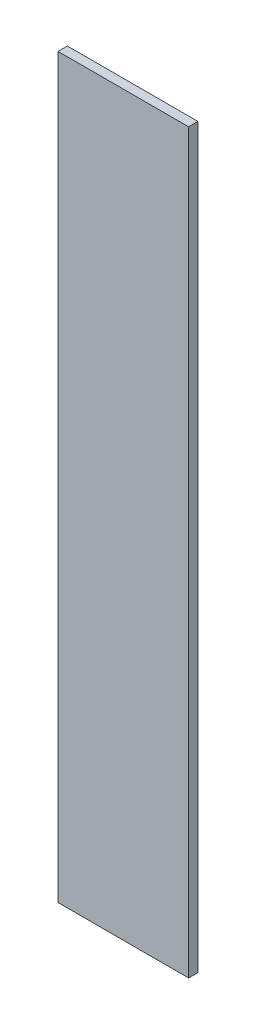
ISO-10303-21;
HEADER;
FILE_DESCRIPTION(('STEP AP214'),'2;1');
FILE_NAME('part.step','',(''),(''),'','','');
FILE_SCHEMA(('AUTOMOTIVE_DESIGN { 1 0 10303 214 1 1 1 1 }'));
ENDSEC;
DATA;
#1=APPLICATION_CONTEXT('core data for automotive mechanical design processes');
#2=APPLICATION_PROTOCOL_DEFINITION('international standard','automotive_design',2000,#1);
#3=PRODUCT_CONTEXT('',#1,'mechanical');
#4=PRODUCT('Part','Part','',(#3));
#5=PRODUCT_RELATED_PRODUCT_CATEGORY('part','',(#4));
#6=PRODUCT_DEFINITION_FORMATION('','',#4);
#7=PRODUCT_DEFINITION_CONTEXT('part definition',#1,'design');
#8=PRODUCT_DEFINITION('design','',#6,#7);
#9=PRODUCT_DEFINITION_SHAPE('','',#8);
#10=(LENGTH_UNIT() NAMED_UNIT(*) SI_UNIT(.MILLI.,.METRE.));
#11=(NAMED_UNIT(*) PLANE_ANGLE_UNIT() SI_UNIT($,.RADIAN.));
#12=(NAMED_UNIT(*) SI_UNIT($,.STERADIAN.) SOLID_ANGLE_UNIT());
#13=UNCERTAINTY_MEASURE_WITH_UNIT(LENGTH_MEASURE(1.E-05),#10,'distance_accuracy_value','');
#14=(GEOMETRIC_REPRESENTATION_CONTEXT(3) GLOBAL_UNCERTAINTY_ASSIGNED_CONTEXT((#13)) GLOBAL_UNIT_ASSIGNED_CONTEXT((#10,
#11,#12)) REPRESENTATION_CONTEXT('',''));
#15=CARTESIAN_POINT('',(0.,0.,0.));
#16=DIRECTION('',(0.,0.,1.));
#17=DIRECTION('',(1.,0.,0.));
#18=AXIS2_PLACEMENT_3D('',#15,#16,#17);
#19=CARTESIAN_POINT('',(0.,0.,6.35));
#20=DIRECTION('',(0.,0.,1.));
#21=DIRECTION('',(1.,0.,0.));
#22=AXIS2_PLACEMENT_3D('',#19,#20,#21);
#23=PLANE('',#22);
#24=DIRECTION('',(0.,1.,0.));
#25=VECTOR('',#24,1.);
#26=CARTESIAN_POINT('',(0.,501.65,6.35));
#27=LINE('',#26,#25);
#28=CARTESIAN_POINT('',(0.,0.,6.35));
#29=VERTEX_POINT('',#28);
#30=CARTESIAN_POINT('',(0.,501.65,6.35));
#31=VERTEX_POINT('',#30);
#32=EDGE_CURVE('E67',#29,#31,#27,.T.);
#33=ORIENTED_EDGE('',*,*,#32,.F.);
#34=DIRECTION('',(1.,0.,0.));
#35=VECTOR('',#34,1.);
#36=CARTESIAN_POINT('',(0.,0.,6.35));
#37=LINE('',#36,#35);
#38=CARTESIAN_POINT('',(88.9,0.,6.35));
#39=VERTEX_POINT('',#38);
#40=EDGE_CURVE('E19',#39,#29,#37,.F.);
#41=ORIENTED_EDGE('',*,*,#40,.F.);
#42=DIRECTION('',(0.,1.,0.));
#43=VECTOR('',#42,1.);
#44=CARTESIAN_POINT('',(88.9,0.,6.35));
#45=LINE('',#44,#43);
#46=CARTESIAN_POINT('',(88.9,501.65,6.35));
#47=VERTEX_POINT('',#46);
#48=EDGE_CURVE('E57',#47,#39,#45,.F.);
#49=ORIENTED_EDGE('',*,*,#48,.F.);
#50=DIRECTION('',(1.,0.,0.));
#51=VECTOR('',#50,1.);
#52=CARTESIAN_POINT('',(88.9,501.65,6.35));
#53=LINE('',#52,#51);
#54=EDGE_CURVE('E52',#31,#47,#53,.T.);
#55=ORIENTED_EDGE('',*,*,#54,.F.);
#56=EDGE_LOOP('',(#33,#41,#49,#55));
#57=FACE_BOUND('',#56,.T.);
#58=ADVANCED_FACE('F16',(#57),#23,.T.);
#59=CARTESIAN_POINT('',(0.,0.,0.));
#60=DIRECTION('',(0.,-1.,0.));
#61=DIRECTION('',(0.,0.,-1.));
#62=AXIS2_PLACEMENT_3D('',#59,#60,#61);
#63=PLANE('',#62);
#64=DIRECTION('',(0.,0.,1.));
#65=VECTOR('',#64,1.);
#66=CARTESIAN_POINT('',(0.,0.,0.));
#67=LINE('',#66,#65);
#68=CARTESIAN_POINT('',(0.,0.,0.));
#69=VERTEX_POINT('',#68);
#70=EDGE_CURVE('E78',#69,#29,#67,.T.);
#71=ORIENTED_EDGE('',*,*,#70,.F.);
#72=DIRECTION('',(1.,0.,0.));
#73=VECTOR('',#72,1.);
#74=CARTESIAN_POINT('',(0.,0.,0.));
#75=LINE('',#74,#73);
#76=CARTESIAN_POINT('',(88.9,0.,0.));
#77=VERTEX_POINT('',#76);
#78=EDGE_CURVE('E73',#69,#77,#75,.T.);
#79=ORIENTED_EDGE('',*,*,#78,.T.);
#80=DIRECTION('',(0.,0.,-1.));
#81=VECTOR('',#80,1.);
#82=CARTESIAN_POINT('',(88.9,0.,0.));
#83=LINE('',#82,#81);
#84=EDGE_CURVE('E62',#39,#77,#83,.T.);
#85=ORIENTED_EDGE('',*,*,#84,.F.);
#86=ORIENTED_EDGE('',*,*,#40,.T.);
#87=EDGE_LOOP('',(#71,#79,#85,#86));
#88=FACE_BOUND('',#87,.T.);
#89=ADVANCED_FACE('F72',(#88),#63,.T.);
#90=CARTESIAN_POINT('',(88.9,0.,0.));
#91=DIRECTION('',(1.,0.,0.));
#92=DIRECTION('',(0.,0.,-1.));
#93=AXIS2_PLACEMENT_3D('',#90,#91,#92);
#94=PLANE('',#93);
#95=ORIENTED_EDGE('',*,*,#84,.T.);
#96=DIRECTION('',(0.,1.,0.));
#97=VECTOR('',#96,1.);
#98=CARTESIAN_POINT('',(88.9,0.,0.));
#99=LINE('',#98,#97);
#100=CARTESIAN_POINT('',(88.9,501.65,0.));
#101=VERTEX_POINT('',#100);
#102=EDGE_CURVE('E83',#77,#101,#99,.T.);
#103=ORIENTED_EDGE('',*,*,#102,.T.);
#104=DIRECTION('',(0.,0.,1.));
#105=VECTOR('',#104,1.);
#106=CARTESIAN_POINT('',(88.9,501.65,0.));
#107=LINE('',#106,#105);
#108=EDGE_CURVE('E64',#47,#101,#107,.F.);
#109=ORIENTED_EDGE('',*,*,#108,.F.);
#110=ORIENTED_EDGE('',*,*,#48,.T.);
#111=EDGE_LOOP('',(#95,#103,#109,#110));
#112=FACE_BOUND('',#111,.T.);
#113=ADVANCED_FACE('F59',(#112),#94,.T.);
#114=CARTESIAN_POINT('',(88.9,501.65,0.));
#115=DIRECTION('',(0.,1.,0.));
#116=DIRECTION('',(0.,0.,1.));
#117=AXIS2_PLACEMENT_3D('',#114,#115,#116);
#118=PLANE('',#117);
#119=ORIENTED_EDGE('',*,*,#108,.T.);
#120=DIRECTION('',(1.,0.,0.));
#121=VECTOR('',#120,1.);
#122=CARTESIAN_POINT('',(0.,501.65,0.));
#123=LINE('',#122,#121);
#124=CARTESIAN_POINT('',(0.,501.65,0.));
#125=VERTEX_POINT('',#124);
#126=EDGE_CURVE('E25',#101,#125,#123,.F.);
#127=ORIENTED_EDGE('',*,*,#126,.T.);
#128=DIRECTION('',(0.,0.,1.));
#129=VECTOR('',#128,1.);
#130=CARTESIAN_POINT('',(0.,501.65,0.));
#131=LINE('',#130,#129);
#132=EDGE_CURVE('E33',#31,#125,#131,.F.);
#133=ORIENTED_EDGE('',*,*,#132,.F.);
#134=ORIENTED_EDGE('',*,*,#54,.T.);
#135=EDGE_LOOP('',(#119,#127,#133,#134));
#136=FACE_BOUND('',#135,.T.);
#137=ADVANCED_FACE('F87',(#136),#118,.T.);
#138=CARTESIAN_POINT('',(0.,501.65,0.));
#139=DIRECTION('',(-1.,0.,0.));
#140=DIRECTION('',(0.,0.,1.));
#141=AXIS2_PLACEMENT_3D('',#138,#139,#140);
#142=PLANE('',#141);
#143=ORIENTED_EDGE('',*,*,#132,.T.);
#144=DIRECTION('',(0.,1.,0.));
#145=VECTOR('',#144,1.);
#146=CARTESIAN_POINT('',(0.,0.,0.));
#147=LINE('',#146,#145);
#148=EDGE_CURVE('E11',#125,#69,#147,.F.);
#149=ORIENTED_EDGE('',*,*,#148,.T.);
#150=ORIENTED_EDGE('',*,*,#70,.T.);
#151=ORIENTED_EDGE('',*,*,#32,.T.);
#152=EDGE_LOOP('',(#143,#149,#150,#151));
#153=FACE_BOUND('',#152,.T.);
#154=ADVANCED_FACE('F90',(#153),#142,.T.);
#155=CARTESIAN_POINT('',(0.,0.,0.));
#156=DIRECTION('',(0.,0.,1.));
#157=DIRECTION('',(1.,0.,0.));
#158=AXIS2_PLACEMENT_3D('',#155,#156,#157);
#159=PLANE('',#158);
#160=ORIENTED_EDGE('',*,*,#126,.F.);
#161=ORIENTED_EDGE('',*,*,#102,.F.);
#162=ORIENTED_EDGE('',*,*,#78,.F.);
#163=ORIENTED_EDGE('',*,*,#148,.F.);
#164=EDGE_LOOP('',(#160,#161,#162,#163));
#165=FACE_BOUND('',#164,.T.);
#166=ADVANCED_FACE('F89',(#165),#159,.F.);
#167=CLOSED_SHELL('',(#58,#89,#113,#137,#154,#166));
#168=MANIFOLD_SOLID_BREP('B1',#167);
#169=ADVANCED_BREP_SHAPE_REPRESENTATION('',(#18,#168),#14);
#170=SHAPE_DEFINITION_REPRESENTATION(#9,#169);
ENDSEC;
END-ISO-10303-21;
